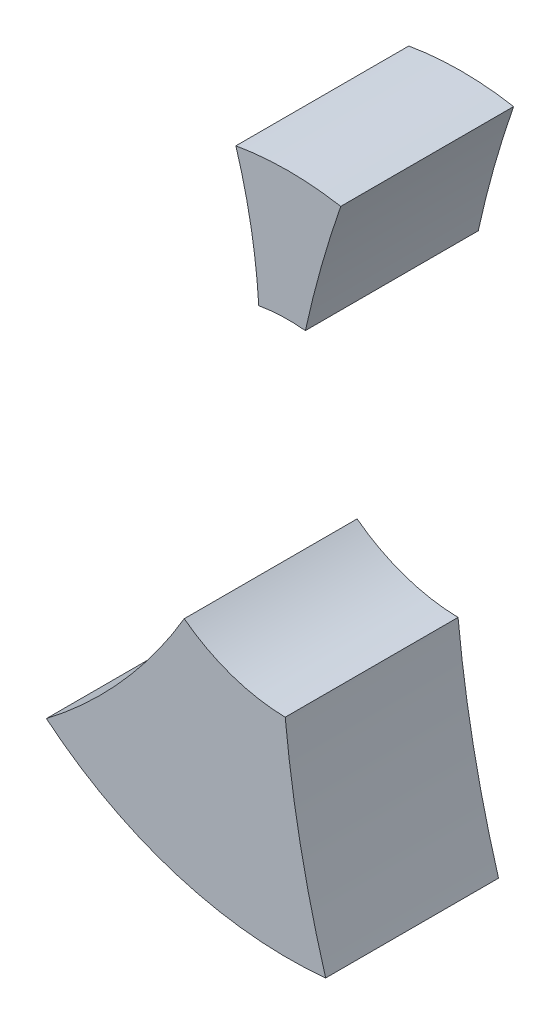
ISO-10303-21;
HEADER;
FILE_DESCRIPTION(('STEP AP214'),'2;1');
FILE_NAME('part.step','',(''),(''),'','','');
FILE_SCHEMA(('AUTOMOTIVE_DESIGN { 1 0 10303 214 1 1 1 1 }'));
ENDSEC;
DATA;
#1=APPLICATION_CONTEXT('core data for automotive mechanical design processes');
#2=APPLICATION_PROTOCOL_DEFINITION('international standard','automotive_design',2000,#1);
#3=PRODUCT_CONTEXT('',#1,'mechanical');
#4=PRODUCT('Part','Part','',(#3));
#5=PRODUCT_RELATED_PRODUCT_CATEGORY('part','',(#4));
#6=PRODUCT_DEFINITION_FORMATION('','',#4);
#7=PRODUCT_DEFINITION_CONTEXT('part definition',#1,'design');
#8=PRODUCT_DEFINITION('design','',#6,#7);
#9=PRODUCT_DEFINITION_SHAPE('','',#8);
#10=(LENGTH_UNIT() NAMED_UNIT(*) SI_UNIT(.MILLI.,.METRE.));
#11=(NAMED_UNIT(*) PLANE_ANGLE_UNIT() SI_UNIT($,.RADIAN.));
#12=(NAMED_UNIT(*) SI_UNIT($,.STERADIAN.) SOLID_ANGLE_UNIT());
#13=UNCERTAINTY_MEASURE_WITH_UNIT(LENGTH_MEASURE(1.E-05),#10,'distance_accuracy_value','');
#14=(GEOMETRIC_REPRESENTATION_CONTEXT(3) GLOBAL_UNCERTAINTY_ASSIGNED_CONTEXT((#13)) GLOBAL_UNIT_ASSIGNED_CONTEXT((#10,
#11,#12)) REPRESENTATION_CONTEXT('',''));
#15=CARTESIAN_POINT('',(0.,0.,0.));
#16=DIRECTION('',(0.,0.,1.));
#17=DIRECTION('',(1.,0.,0.));
#18=AXIS2_PLACEMENT_3D('',#15,#16,#17);
#19=CARTESIAN_POINT('',(0.,0.,6.));
#20=DIRECTION('',(0.,0.,1.));
#21=DIRECTION('',(1.,0.,0.));
#22=AXIS2_PLACEMENT_3D('',#19,#20,#21);
#23=PLANE('',#22);
#24=CARTESIAN_POINT('',(-19.8561382170356,4.79819542579186,6.));
#25=DIRECTION('',(0.,0.,1.));
#26=DIRECTION('',(1.,0.,0.));
#27=AXIS2_PLACEMENT_3D('',#24,#25,#26);
#28=CIRCLE('',#27,18.8626078830791);
#29=CARTESIAN_POINT('',(-8.39709191676248,-10.1847359976311,6.));
#30=VERTEX_POINT('',#29);
#31=CARTESIAN_POINT('',(-3.61255953004087,-4.79055462779738,6.));
#32=VERTEX_POINT('',#31);
#33=EDGE_CURVE('E51',#30,#32,#28,.T.);
#34=ORIENTED_EDGE('',*,*,#33,.F.);
#35=CARTESIAN_POINT('',(0.,0.,6.));
#36=DIRECTION('',(0.,0.,1.));
#37=DIRECTION('',(1.,0.,0.));
#38=AXIS2_PLACEMENT_3D('',#35,#36,#37);
#39=CIRCLE('',#38,13.2);
#40=CARTESIAN_POINT('',(1.29641261322865,-13.1361834006785,6.));
#41=VERTEX_POINT('',#40);
#42=EDGE_CURVE('E114',#30,#41,#39,.T.);
#43=ORIENTED_EDGE('',*,*,#42,.T.);
#44=CARTESIAN_POINT('',(37.9293303120853,-2.21973643094651,6.));
#45=DIRECTION('',(0.,0.,-1.));
#46=DIRECTION('',(-1.,0.,0.));
#47=AXIS2_PLACEMENT_3D('',#44,#45,#46);
#48=CIRCLE('',#47,38.2248541341124);
#49=CARTESIAN_POINT('',(-0.108236139695649,-5.99902366540289,6.));
#50=VERTEX_POINT('',#49);
#51=EDGE_CURVE('E81',#41,#50,#48,.T.);
#52=ORIENTED_EDGE('',*,*,#51,.T.);
#53=CARTESIAN_POINT('',(0.,0.,6.));
#54=DIRECTION('',(0.,0.,1.));
#55=DIRECTION('',(1.,0.,0.));
#56=AXIS2_PLACEMENT_3D('',#53,#54,#55);
#57=CIRCLE('',#56,6.);
#58=EDGE_CURVE('E105',#32,#50,#57,.T.);
#59=ORIENTED_EDGE('',*,*,#58,.F.);
#60=EDGE_LOOP('',(#34,#43,#52,#59));
#61=FACE_BOUND('',#60,.T.);
#62=ADVANCED_FACE('F47',(#61),#23,.T.);
#63=CARTESIAN_POINT('',(0.,0.,0.));
#64=DIRECTION('',(0.,0.,1.));
#65=DIRECTION('',(1.,0.,0.));
#66=AXIS2_PLACEMENT_3D('',#63,#64,#65);
#67=PLANE('',#66);
#68=CARTESIAN_POINT('',(0.,0.,0.));
#69=DIRECTION('',(0.,0.,1.));
#70=DIRECTION('',(1.,0.,0.));
#71=AXIS2_PLACEMENT_3D('',#68,#69,#70);
#72=CIRCLE('',#71,13.2);
#73=CARTESIAN_POINT('',(-8.39709191676248,-10.1847359976311,0.));
#74=VERTEX_POINT('',#73);
#75=CARTESIAN_POINT('',(1.29641261322865,-13.1361834006785,0.));
#76=VERTEX_POINT('',#75);
#77=EDGE_CURVE('E109',#74,#76,#72,.T.);
#78=ORIENTED_EDGE('',*,*,#77,.F.);
#79=CARTESIAN_POINT('',(-19.8561382170356,4.79819542579186,0.));
#80=DIRECTION('',(0.,0.,1.));
#81=DIRECTION('',(1.,0.,0.));
#82=AXIS2_PLACEMENT_3D('',#79,#80,#81);
#83=CIRCLE('',#82,18.8626078830791);
#84=CARTESIAN_POINT('',(-3.61255953004087,-4.79055462779738,0.));
#85=VERTEX_POINT('',#84);
#86=EDGE_CURVE('E68',#74,#85,#83,.T.);
#87=ORIENTED_EDGE('',*,*,#86,.T.);
#88=CARTESIAN_POINT('',(0.,0.,0.));
#89=DIRECTION('',(0.,0.,1.));
#90=DIRECTION('',(1.,0.,0.));
#91=AXIS2_PLACEMENT_3D('',#88,#89,#90);
#92=CIRCLE('',#91,6.);
#93=CARTESIAN_POINT('',(-0.108236139695648,-5.99902366540288,0.));
#94=VERTEX_POINT('',#93);
#95=EDGE_CURVE('E103',#85,#94,#92,.T.);
#96=ORIENTED_EDGE('',*,*,#95,.T.);
#97=CARTESIAN_POINT('',(37.9293303120853,-2.21973643094651,0.));
#98=DIRECTION('',(0.,0.,-1.));
#99=DIRECTION('',(-1.,0.,0.));
#100=AXIS2_PLACEMENT_3D('',#97,#98,#99);
#101=CIRCLE('',#100,38.2248541341124);
#102=EDGE_CURVE('E90',#76,#94,#101,.T.);
#103=ORIENTED_EDGE('',*,*,#102,.F.);
#104=EDGE_LOOP('',(#78,#87,#96,#103));
#105=FACE_BOUND('',#104,.T.);
#106=ADVANCED_FACE('F107',(#105),#67,.F.);
#107=CARTESIAN_POINT('',(0.,0.,6.));
#108=DIRECTION('',(0.,0.,-1.));
#109=DIRECTION('',(-1.,0.,0.));
#110=AXIS2_PLACEMENT_3D('',#107,#108,#109);
#111=CYLINDRICAL_SURFACE('',#110,13.2);
#112=ORIENTED_EDGE('',*,*,#42,.F.);
#113=DIRECTION('',(0.,0.,1.));
#114=VECTOR('',#113,1.);
#115=CARTESIAN_POINT('',(-8.39709191676248,-10.1847359976311,3.));
#116=LINE('',#115,#114);
#117=EDGE_CURVE('E63',#30,#74,#116,.F.);
#118=ORIENTED_EDGE('',*,*,#117,.T.);
#119=ORIENTED_EDGE('',*,*,#77,.T.);
#120=DIRECTION('',(0.,0.,1.));
#121=VECTOR('',#120,1.);
#122=CARTESIAN_POINT('',(1.29641261322865,-13.1361834006785,3.));
#123=LINE('',#122,#121);
#124=EDGE_CURVE('E88',#41,#76,#123,.F.);
#125=ORIENTED_EDGE('',*,*,#124,.F.);
#126=EDGE_LOOP('',(#112,#118,#119,#125));
#127=FACE_BOUND('',#126,.T.);
#128=ADVANCED_FACE('F121',(#127),#111,.T.);
#129=CARTESIAN_POINT('',(0.,0.,6.));
#130=DIRECTION('',(0.,0.,-1.));
#131=DIRECTION('',(-1.,0.,0.));
#132=AXIS2_PLACEMENT_3D('',#129,#130,#131);
#133=CYLINDRICAL_SURFACE('',#132,6.);
#134=DIRECTION('',(0.,0.,1.));
#135=VECTOR('',#134,1.);
#136=CARTESIAN_POINT('',(-3.61255953004087,-4.79055462779738,3.));
#137=LINE('',#136,#135);
#138=EDGE_CURVE('E12',#32,#85,#137,.F.);
#139=ORIENTED_EDGE('',*,*,#138,.F.);
#140=ORIENTED_EDGE('',*,*,#58,.T.);
#141=DIRECTION('',(0.,0.,1.));
#142=VECTOR('',#141,1.);
#143=CARTESIAN_POINT('',(-0.108236139695642,-5.99902366540288,3.));
#144=LINE('',#143,#142);
#145=EDGE_CURVE('E93',#50,#94,#144,.F.);
#146=ORIENTED_EDGE('',*,*,#145,.T.);
#147=ORIENTED_EDGE('',*,*,#95,.F.);
#148=EDGE_LOOP('',(#139,#140,#146,#147));
#149=FACE_BOUND('',#148,.T.);
#150=ADVANCED_FACE('F102',(#149),#133,.F.);
#151=CARTESIAN_POINT('',(37.9293303120853,-2.21973643094651,0.));
#152=DIRECTION('',(0.,0.,1.));
#153=DIRECTION('',(1.,0.,0.));
#154=AXIS2_PLACEMENT_3D('',#151,#152,#153);
#155=CYLINDRICAL_SURFACE('',#154,38.2248541341124);
#156=ORIENTED_EDGE('',*,*,#124,.T.);
#157=ORIENTED_EDGE('',*,*,#102,.T.);
#158=ORIENTED_EDGE('',*,*,#145,.F.);
#159=ORIENTED_EDGE('',*,*,#51,.F.);
#160=EDGE_LOOP('',(#156,#157,#158,#159));
#161=FACE_BOUND('',#160,.T.);
#162=ADVANCED_FACE('F92',(#161),#155,.F.);
#163=CARTESIAN_POINT('',(-19.8561382170356,4.79819542579186,0.));
#164=DIRECTION('',(0.,0.,1.));
#165=DIRECTION('',(1.,0.,0.));
#166=AXIS2_PLACEMENT_3D('',#163,#164,#165);
#167=CYLINDRICAL_SURFACE('',#166,18.8626078830791);
#168=ORIENTED_EDGE('',*,*,#33,.T.);
#169=ORIENTED_EDGE('',*,*,#138,.T.);
#170=ORIENTED_EDGE('',*,*,#86,.F.);
#171=ORIENTED_EDGE('',*,*,#117,.F.);
#172=EDGE_LOOP('',(#168,#169,#170,#171));
#173=FACE_BOUND('',#172,.T.);
#174=ADVANCED_FACE('F49',(#173),#167,.F.);
#175=CLOSED_SHELL('',(#62,#106,#128,#150,#162,#174));
#176=MANIFOLD_SOLID_BREP('B2',#175);
#177=CARTESIAN_POINT('',(0.,0.,6.));
#178=DIRECTION('',(0.,0.,-1.));
#179=DIRECTION('',(-1.,0.,0.));
#180=AXIS2_PLACEMENT_3D('',#177,#178,#179);
#181=CYLINDRICAL_SURFACE('',#180,6.);
#182=DIRECTION('',(0.,0.,1.));
#183=VECTOR('',#182,1.);
#184=CARTESIAN_POINT('',(-1.02641678432622,5.91155382153063,3.));
#185=LINE('',#184,#183);
#186=CARTESIAN_POINT('',(-1.02641678432622,5.91155382153063,0.));
#187=VERTEX_POINT('',#186);
#188=CARTESIAN_POINT('',(-1.02641678432622,5.91155382153063,6.));
#189=VERTEX_POINT('',#188);
#190=EDGE_CURVE('E45',#187,#189,#185,.T.);
#191=ORIENTED_EDGE('',*,*,#190,.F.);
#192=CARTESIAN_POINT('',(0.,0.,0.));
#193=DIRECTION('',(0.,0.,1.));
#194=DIRECTION('',(1.,0.,0.));
#195=AXIS2_PLACEMENT_3D('',#192,#193,#194);
#196=CIRCLE('',#195,6.);
#197=CARTESIAN_POINT('',(0.592267249714763,5.97069673529944,0.));
#198=VERTEX_POINT('',#197);
#199=EDGE_CURVE('E241',#198,#187,#196,.T.);
#200=ORIENTED_EDGE('',*,*,#199,.F.);
#201=DIRECTION('',(0.,0.,1.));
#202=VECTOR('',#201,1.);
#203=CARTESIAN_POINT('',(0.592267249714763,5.97069673529943,3.));
#204=LINE('',#203,#202);
#205=CARTESIAN_POINT('',(0.592267249714763,5.97069673529943,6.));
#206=VERTEX_POINT('',#205);
#207=EDGE_CURVE('E191',#198,#206,#204,.T.);
#208=ORIENTED_EDGE('',*,*,#207,.T.);
#209=CARTESIAN_POINT('',(0.,0.,6.));
#210=DIRECTION('',(0.,0.,1.));
#211=DIRECTION('',(1.,0.,0.));
#212=AXIS2_PLACEMENT_3D('',#209,#210,#211);
#213=CIRCLE('',#212,6.);
#214=EDGE_CURVE('E250',#206,#189,#213,.T.);
#215=ORIENTED_EDGE('',*,*,#214,.T.);
#216=EDGE_LOOP('',(#191,#200,#208,#215));
#217=FACE_BOUND('',#216,.T.);
#218=ADVANCED_FACE('F183',(#217),#181,.F.);
#219=CARTESIAN_POINT('',(0.,0.,0.));
#220=DIRECTION('',(0.,0.,1.));
#221=DIRECTION('',(1.,0.,0.));
#222=AXIS2_PLACEMENT_3D('',#219,#220,#221);
#223=PLANE('',#222);
#224=ORIENTED_EDGE('',*,*,#199,.T.);
#225=CARTESIAN_POINT('',(-19.8561382170356,4.79819542579186,0.));
#226=DIRECTION('',(0.,0.,1.));
#227=DIRECTION('',(1.,0.,0.));
#228=AXIS2_PLACEMENT_3D('',#225,#226,#227);
#229=CIRCLE('',#228,18.8626078830791);
#230=CARTESIAN_POINT('',(-1.81985117133101,10.32,0.));
#231=VERTEX_POINT('',#230);
#232=EDGE_CURVE('E223',#187,#231,#229,.T.);
#233=ORIENTED_EDGE('',*,*,#232,.T.);
#234=CARTESIAN_POINT('',(0.,0.,0.));
#235=DIRECTION('',(0.,0.,-1.));
#236=DIRECTION('',(-1.,0.,0.));
#237=AXIS2_PLACEMENT_3D('',#234,#235,#236);
#238=CIRCLE('',#237,10.4792298517494);
#239=CARTESIAN_POINT('',(1.81985117133102,10.32,0.));
#240=VERTEX_POINT('',#239);
#241=EDGE_CURVE('E235',#231,#240,#238,.T.);
#242=ORIENTED_EDGE('',*,*,#241,.T.);
#243=CARTESIAN_POINT('',(37.9293303120853,-2.21973643094651,0.));
#244=DIRECTION('',(0.,0.,-1.));
#245=DIRECTION('',(-1.,0.,0.));
#246=AXIS2_PLACEMENT_3D('',#243,#244,#245);
#247=CIRCLE('',#246,38.2248541341124);
#248=EDGE_CURVE('E231',#198,#240,#247,.T.);
#249=ORIENTED_EDGE('',*,*,#248,.F.);
#250=EDGE_LOOP('',(#224,#233,#242,#249));
#251=FACE_BOUND('',#250,.T.);
#252=ADVANCED_FACE('F185',(#251),#223,.F.);
#253=CARTESIAN_POINT('',(0.,0.,6.));
#254=DIRECTION('',(0.,0.,1.));
#255=DIRECTION('',(1.,0.,0.));
#256=AXIS2_PLACEMENT_3D('',#253,#254,#255);
#257=PLANE('',#256);
#258=CARTESIAN_POINT('',(-19.8561382170356,4.79819542579186,6.));
#259=DIRECTION('',(0.,0.,1.));
#260=DIRECTION('',(1.,0.,0.));
#261=AXIS2_PLACEMENT_3D('',#258,#259,#260);
#262=CIRCLE('',#261,18.8626078830791);
#263=CARTESIAN_POINT('',(-1.81985117133101,10.32,6.));
#264=VERTEX_POINT('',#263);
#265=EDGE_CURVE('E226',#189,#264,#262,.T.);
#266=ORIENTED_EDGE('',*,*,#265,.F.);
#267=ORIENTED_EDGE('',*,*,#214,.F.);
#268=CARTESIAN_POINT('',(37.9293303120853,-2.21973643094651,6.));
#269=DIRECTION('',(0.,0.,-1.));
#270=DIRECTION('',(-1.,0.,0.));
#271=AXIS2_PLACEMENT_3D('',#268,#269,#270);
#272=CIRCLE('',#271,38.2248541341124);
#273=CARTESIAN_POINT('',(1.81985117133102,10.32,6.));
#274=VERTEX_POINT('',#273);
#275=EDGE_CURVE('E198',#206,#274,#272,.T.);
#276=ORIENTED_EDGE('',*,*,#275,.T.);
#277=CARTESIAN_POINT('',(0.,0.,6.));
#278=DIRECTION('',(0.,0.,-1.));
#279=DIRECTION('',(-1.,0.,0.));
#280=AXIS2_PLACEMENT_3D('',#277,#278,#279);
#281=CIRCLE('',#280,10.4792298517494);
#282=EDGE_CURVE('E243',#264,#274,#281,.T.);
#283=ORIENTED_EDGE('',*,*,#282,.F.);
#284=EDGE_LOOP('',(#266,#267,#276,#283));
#285=FACE_BOUND('',#284,.T.);
#286=ADVANCED_FACE('F256',(#285),#257,.T.);
#287=CARTESIAN_POINT('',(37.9293303120853,-2.21973643094651,0.));
#288=DIRECTION('',(0.,0.,1.));
#289=DIRECTION('',(1.,0.,0.));
#290=AXIS2_PLACEMENT_3D('',#287,#288,#289);
#291=CYLINDRICAL_SURFACE('',#290,38.2248541341124);
#292=ORIENTED_EDGE('',*,*,#248,.T.);
#293=DIRECTION('',(0.,0.,1.));
#294=VECTOR('',#293,1.);
#295=CARTESIAN_POINT('',(1.81985117133102,10.32,0.));
#296=LINE('',#295,#294);
#297=EDGE_CURVE('E230',#240,#274,#296,.T.);
#298=ORIENTED_EDGE('',*,*,#297,.T.);
#299=ORIENTED_EDGE('',*,*,#275,.F.);
#300=ORIENTED_EDGE('',*,*,#207,.F.);
#301=EDGE_LOOP('',(#292,#298,#299,#300));
#302=FACE_BOUND('',#301,.T.);
#303=ADVANCED_FACE('F258',(#302),#291,.F.);
#304=CARTESIAN_POINT('',(-19.8561382170356,4.79819542579186,0.));
#305=DIRECTION('',(0.,0.,1.));
#306=DIRECTION('',(1.,0.,0.));
#307=AXIS2_PLACEMENT_3D('',#304,#305,#306);
#308=CYLINDRICAL_SURFACE('',#307,18.8626078830791);
#309=ORIENTED_EDGE('',*,*,#190,.T.);
#310=ORIENTED_EDGE('',*,*,#265,.T.);
#311=DIRECTION('',(0.,0.,1.));
#312=VECTOR('',#311,1.);
#313=CARTESIAN_POINT('',(-1.81985117133101,10.32,0.));
#314=LINE('',#313,#312);
#315=EDGE_CURVE('E219',#231,#264,#314,.T.);
#316=ORIENTED_EDGE('',*,*,#315,.F.);
#317=ORIENTED_EDGE('',*,*,#232,.F.);
#318=EDGE_LOOP('',(#309,#310,#316,#317));
#319=FACE_BOUND('',#318,.T.);
#320=ADVANCED_FACE('F221',(#319),#308,.F.);
#321=CARTESIAN_POINT('',(0.,0.,0.));
#322=DIRECTION('',(0.,0.,1.));
#323=DIRECTION('',(1.,0.,0.));
#324=AXIS2_PLACEMENT_3D('',#321,#322,#323);
#325=CYLINDRICAL_SURFACE('',#324,10.4792298517494);
#326=ORIENTED_EDGE('',*,*,#282,.T.);
#327=ORIENTED_EDGE('',*,*,#297,.F.);
#328=ORIENTED_EDGE('',*,*,#241,.F.);
#329=ORIENTED_EDGE('',*,*,#315,.T.);
#330=EDGE_LOOP('',(#326,#327,#328,#329));
#331=FACE_BOUND('',#330,.T.);
#332=ADVANCED_FACE('F236',(#331),#325,.T.);
#333=CLOSED_SHELL('',(#218,#252,#286,#303,#320,#332));
#334=MANIFOLD_SOLID_BREP('B6',#333);
#335=ADVANCED_BREP_SHAPE_REPRESENTATION('',(#18,#176,#334),#14);
#336=SHAPE_DEFINITION_REPRESENTATION(#9,#335);
ENDSEC;
END-ISO-10303-21;
